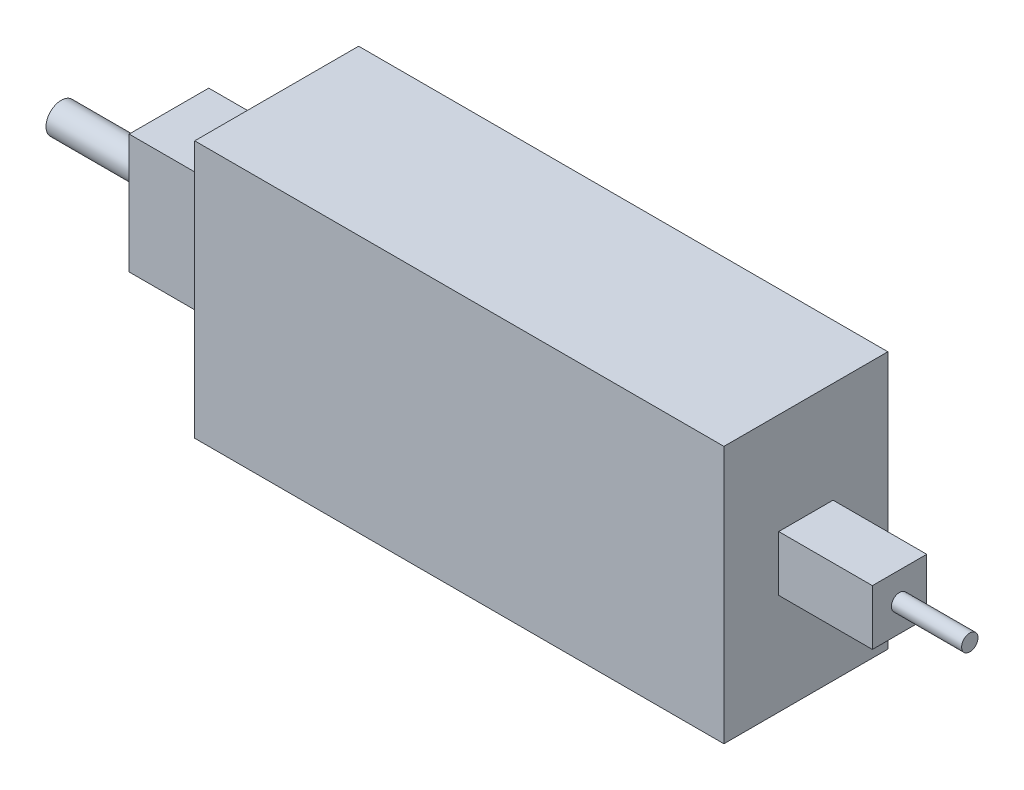
ISO-10303-21;
HEADER;
FILE_DESCRIPTION(('STEP AP214'),'2;1');
FILE_NAME('part.step','',(''),(''),'','','');
FILE_SCHEMA(('AUTOMOTIVE_DESIGN { 1 0 10303 214 1 1 1 1 }'));
ENDSEC;
DATA;
#1=APPLICATION_CONTEXT('core data for automotive mechanical design processes');
#2=APPLICATION_PROTOCOL_DEFINITION('international standard','automotive_design',2000,#1);
#3=PRODUCT_CONTEXT('',#1,'mechanical');
#4=PRODUCT('Part','Part','',(#3));
#5=PRODUCT_RELATED_PRODUCT_CATEGORY('part','',(#4));
#6=PRODUCT_DEFINITION_FORMATION('','',#4);
#7=PRODUCT_DEFINITION_CONTEXT('part definition',#1,'design');
#8=PRODUCT_DEFINITION('design','',#6,#7);
#9=PRODUCT_DEFINITION_SHAPE('','',#8);
#10=(LENGTH_UNIT() NAMED_UNIT(*) SI_UNIT(.MILLI.,.METRE.));
#11=(NAMED_UNIT(*) PLANE_ANGLE_UNIT() SI_UNIT($,.RADIAN.));
#12=(NAMED_UNIT(*) SI_UNIT($,.STERADIAN.) SOLID_ANGLE_UNIT());
#13=UNCERTAINTY_MEASURE_WITH_UNIT(LENGTH_MEASURE(1.E-05),#10,'distance_accuracy_value','');
#14=(GEOMETRIC_REPRESENTATION_CONTEXT(3) GLOBAL_UNCERTAINTY_ASSIGNED_CONTEXT((#13)) GLOBAL_UNIT_ASSIGNED_CONTEXT((#10,
#11,#12)) REPRESENTATION_CONTEXT('',''));
#15=CARTESIAN_POINT('',(0.,0.,0.));
#16=DIRECTION('',(0.,0.,1.));
#17=DIRECTION('',(1.,0.,0.));
#18=AXIS2_PLACEMENT_3D('',#15,#16,#17);
#19=CARTESIAN_POINT('',(0.,0.,35.));
#20=DIRECTION('',(1.,0.,0.));
#21=DIRECTION('',(0.,0.,-1.));
#22=AXIS2_PLACEMENT_3D('',#19,#20,#21);
#23=PLANE('',#22);
#24=DIRECTION('',(0.,-1.,0.));
#25=VECTOR('',#24,1.);
#26=CARTESIAN_POINT('',(0.,0.,0.));
#27=LINE('',#26,#25);
#28=CARTESIAN_POINT('',(0.,55.,0.));
#29=VERTEX_POINT('',#28);
#30=CARTESIAN_POINT('',(0.,0.,0.));
#31=VERTEX_POINT('',#30);
#32=EDGE_CURVE('E190',#29,#31,#27,.T.);
#33=ORIENTED_EDGE('',*,*,#32,.T.);
#34=DIRECTION('',(0.,0.,-1.));
#35=VECTOR('',#34,1.);
#36=CARTESIAN_POINT('',(0.,0.,35.));
#37=LINE('',#36,#35);
#38=CARTESIAN_POINT('',(0.,0.,35.));
#39=VERTEX_POINT('',#38);
#40=EDGE_CURVE('E40',#39,#31,#37,.T.);
#41=ORIENTED_EDGE('',*,*,#40,.F.);
#42=DIRECTION('',(0.,-1.,0.));
#43=VECTOR('',#42,1.);
#44=CARTESIAN_POINT('',(0.,0.,35.));
#45=LINE('',#44,#43);
#46=CARTESIAN_POINT('',(0.,55.,35.));
#47=VERTEX_POINT('',#46);
#48=EDGE_CURVE('E191',#47,#39,#45,.T.);
#49=ORIENTED_EDGE('',*,*,#48,.F.);
#50=DIRECTION('',(0.,0.,-1.));
#51=VECTOR('',#50,1.);
#52=CARTESIAN_POINT('',(0.,55.,35.));
#53=LINE('',#52,#51);
#54=EDGE_CURVE('E201',#47,#29,#53,.T.);
#55=ORIENTED_EDGE('',*,*,#54,.T.);
#56=EDGE_LOOP('',(#33,#41,#49,#55));
#57=FACE_BOUND('',#56,.T.);
#58=DIRECTION('',(0.,-1.,0.));
#59=VECTOR('',#58,1.);
#60=CARTESIAN_POINT('',(0.,40.25,9.));
#61=LINE('',#60,#59);
#62=CARTESIAN_POINT('',(0.,40.25,9.));
#63=VERTEX_POINT('',#62);
#64=CARTESIAN_POINT('',(0.,14.75,9.00000000000001));
#65=VERTEX_POINT('',#64);
#66=EDGE_CURVE('E53',#63,#65,#61,.T.);
#67=ORIENTED_EDGE('',*,*,#66,.F.);
#68=DIRECTION('',(0.,0.,-1.));
#69=VECTOR('',#68,1.);
#70=CARTESIAN_POINT('',(0.,40.25,9.));
#71=LINE('',#70,#69);
#72=CARTESIAN_POINT('',(0.,40.25,26.));
#73=VERTEX_POINT('',#72);
#74=EDGE_CURVE('E57',#73,#63,#71,.T.);
#75=ORIENTED_EDGE('',*,*,#74,.F.);
#76=DIRECTION('',(0.,1.,0.));
#77=VECTOR('',#76,1.);
#78=CARTESIAN_POINT('',(0.,40.25,26.));
#79=LINE('',#78,#77);
#80=CARTESIAN_POINT('',(0.,14.75,26.));
#81=VERTEX_POINT('',#80);
#82=EDGE_CURVE('E452',#81,#73,#79,.T.);
#83=ORIENTED_EDGE('',*,*,#82,.F.);
#84=DIRECTION('',(0.,0.,1.));
#85=VECTOR('',#84,1.);
#86=CARTESIAN_POINT('',(0.,14.75,9.00000000000001));
#87=LINE('',#86,#85);
#88=EDGE_CURVE('E445',#65,#81,#87,.T.);
#89=ORIENTED_EDGE('',*,*,#88,.F.);
#90=EDGE_LOOP('',(#67,#75,#83,#89));
#91=FACE_BOUND('',#90,.T.);
#92=ADVANCED_FACE('F37',(#57,#91),#23,.F.);
#93=CARTESIAN_POINT('',(113.,0.,35.));
#94=DIRECTION('',(-1.,0.,0.));
#95=DIRECTION('',(0.,0.,1.));
#96=AXIS2_PLACEMENT_3D('',#93,#94,#95);
#97=PLANE('',#96);
#98=DIRECTION('',(0.,1.,0.));
#99=VECTOR('',#98,1.);
#100=CARTESIAN_POINT('',(113.,0.,0.));
#101=LINE('',#100,#99);
#102=CARTESIAN_POINT('',(113.,0.,0.));
#103=VERTEX_POINT('',#102);
#104=CARTESIAN_POINT('',(113.,55.,0.));
#105=VERTEX_POINT('',#104);
#106=EDGE_CURVE('E206',#103,#105,#101,.T.);
#107=ORIENTED_EDGE('',*,*,#106,.T.);
#108=DIRECTION('',(0.,0.,-1.));
#109=VECTOR('',#108,1.);
#110=CARTESIAN_POINT('',(113.,55.,35.));
#111=LINE('',#110,#109);
#112=CARTESIAN_POINT('',(113.,55.,35.));
#113=VERTEX_POINT('',#112);
#114=EDGE_CURVE('E211',#113,#105,#111,.T.);
#115=ORIENTED_EDGE('',*,*,#114,.F.);
#116=DIRECTION('',(0.,1.,0.));
#117=VECTOR('',#116,1.);
#118=CARTESIAN_POINT('',(113.,0.,35.));
#119=LINE('',#118,#117);
#120=CARTESIAN_POINT('',(113.,0.,35.));
#121=VERTEX_POINT('',#120);
#122=EDGE_CURVE('E197',#121,#113,#119,.T.);
#123=ORIENTED_EDGE('',*,*,#122,.F.);
#124=DIRECTION('',(0.,0.,-1.));
#125=VECTOR('',#124,1.);
#126=CARTESIAN_POINT('',(113.,0.,35.));
#127=LINE('',#126,#125);
#128=EDGE_CURVE('E213',#121,#103,#127,.T.);
#129=ORIENTED_EDGE('',*,*,#128,.T.);
#130=EDGE_LOOP('',(#107,#115,#123,#129));
#131=FACE_BOUND('',#130,.T.);
#132=DIRECTION('',(0.,-1.,0.));
#133=VECTOR('',#132,1.);
#134=CARTESIAN_POINT('',(113.,33.4,23.3));
#135=LINE('',#134,#133);
#136=CARTESIAN_POINT('',(113.,33.4,23.3));
#137=VERTEX_POINT('',#136);
#138=CARTESIAN_POINT('',(113.,21.6,23.3));
#139=VERTEX_POINT('',#138);
#140=EDGE_CURVE('E150',#137,#139,#135,.T.);
#141=ORIENTED_EDGE('',*,*,#140,.F.);
#142=DIRECTION('',(0.,0.,1.));
#143=VECTOR('',#142,1.);
#144=CARTESIAN_POINT('',(113.,33.4,23.3));
#145=LINE('',#144,#143);
#146=CARTESIAN_POINT('',(113.,33.4,11.7));
#147=VERTEX_POINT('',#146);
#148=EDGE_CURVE('E162',#147,#137,#145,.T.);
#149=ORIENTED_EDGE('',*,*,#148,.F.);
#150=DIRECTION('',(0.,1.,0.));
#151=VECTOR('',#150,1.);
#152=CARTESIAN_POINT('',(113.,33.4,11.7));
#153=LINE('',#152,#151);
#154=CARTESIAN_POINT('',(113.,21.6,11.7));
#155=VERTEX_POINT('',#154);
#156=EDGE_CURVE('E174',#155,#147,#153,.T.);
#157=ORIENTED_EDGE('',*,*,#156,.F.);
#158=DIRECTION('',(0.,0.,-1.));
#159=VECTOR('',#158,1.);
#160=CARTESIAN_POINT('',(113.,21.6,23.3));
#161=LINE('',#160,#159);
#162=EDGE_CURVE('E171',#139,#155,#161,.T.);
#163=ORIENTED_EDGE('',*,*,#162,.F.);
#164=EDGE_LOOP('',(#141,#149,#157,#163));
#165=FACE_BOUND('',#164,.T.);
#166=ADVANCED_FACE('F231',(#131,#165),#97,.F.);
#167=CARTESIAN_POINT('',(0.,0.,35.));
#168=DIRECTION('',(0.,1.,0.));
#169=DIRECTION('',(0.,0.,1.));
#170=AXIS2_PLACEMENT_3D('',#167,#168,#169);
#171=PLANE('',#170);
#172=DIRECTION('',(1.,0.,0.));
#173=VECTOR('',#172,1.);
#174=CARTESIAN_POINT('',(0.,0.,0.));
#175=LINE('',#174,#173);
#176=EDGE_CURVE('E204',#31,#103,#175,.T.);
#177=ORIENTED_EDGE('',*,*,#176,.T.);
#178=ORIENTED_EDGE('',*,*,#128,.F.);
#179=DIRECTION('',(1.,0.,0.));
#180=VECTOR('',#179,1.);
#181=CARTESIAN_POINT('',(0.,0.,35.));
#182=LINE('',#181,#180);
#183=EDGE_CURVE('E194',#39,#121,#182,.T.);
#184=ORIENTED_EDGE('',*,*,#183,.F.);
#185=ORIENTED_EDGE('',*,*,#40,.T.);
#186=EDGE_LOOP('',(#177,#178,#184,#185));
#187=FACE_BOUND('',#186,.T.);
#188=ADVANCED_FACE('F222',(#187),#171,.F.);
#189=CARTESIAN_POINT('',(0.,55.,35.));
#190=DIRECTION('',(0.,-1.,0.));
#191=DIRECTION('',(0.,0.,-1.));
#192=AXIS2_PLACEMENT_3D('',#189,#190,#191);
#193=PLANE('',#192);
#194=DIRECTION('',(-1.,0.,0.));
#195=VECTOR('',#194,1.);
#196=CARTESIAN_POINT('',(0.,55.,0.));
#197=LINE('',#196,#195);
#198=EDGE_CURVE('E195',#105,#29,#197,.T.);
#199=ORIENTED_EDGE('',*,*,#198,.T.);
#200=ORIENTED_EDGE('',*,*,#54,.F.);
#201=DIRECTION('',(-1.,0.,0.));
#202=VECTOR('',#201,1.);
#203=CARTESIAN_POINT('',(0.,55.,35.));
#204=LINE('',#203,#202);
#205=EDGE_CURVE('E199',#113,#47,#204,.T.);
#206=ORIENTED_EDGE('',*,*,#205,.F.);
#207=ORIENTED_EDGE('',*,*,#114,.T.);
#208=EDGE_LOOP('',(#199,#200,#206,#207));
#209=FACE_BOUND('',#208,.T.);
#210=ADVANCED_FACE('F235',(#209),#193,.F.);
#211=CARTESIAN_POINT('',(0.,0.,35.));
#212=DIRECTION('',(0.,0.,-1.));
#213=DIRECTION('',(-1.,0.,0.));
#214=AXIS2_PLACEMENT_3D('',#211,#212,#213);
#215=PLANE('',#214);
#216=ORIENTED_EDGE('',*,*,#48,.T.);
#217=ORIENTED_EDGE('',*,*,#183,.T.);
#218=ORIENTED_EDGE('',*,*,#122,.T.);
#219=ORIENTED_EDGE('',*,*,#205,.T.);
#220=EDGE_LOOP('',(#216,#217,#218,#219));
#221=FACE_BOUND('',#220,.T.);
#222=ADVANCED_FACE('F237',(#221),#215,.F.);
#223=CARTESIAN_POINT('',(0.,0.,0.));
#224=DIRECTION('',(0.,0.,-1.));
#225=DIRECTION('',(-1.,0.,0.));
#226=AXIS2_PLACEMENT_3D('',#223,#224,#225);
#227=PLANE('',#226);
#228=ORIENTED_EDGE('',*,*,#32,.F.);
#229=ORIENTED_EDGE('',*,*,#198,.F.);
#230=ORIENTED_EDGE('',*,*,#106,.F.);
#231=ORIENTED_EDGE('',*,*,#176,.F.);
#232=EDGE_LOOP('',(#228,#229,#230,#231));
#233=FACE_BOUND('',#232,.T.);
#234=ADVANCED_FACE('F229',(#233),#227,.T.);
#235=CARTESIAN_POINT('',(133.,33.4,23.3));
#236=DIRECTION('',(0.,0.,-1.));
#237=DIRECTION('',(-1.,0.,0.));
#238=AXIS2_PLACEMENT_3D('',#235,#236,#237);
#239=PLANE('',#238);
#240=ORIENTED_EDGE('',*,*,#140,.T.);
#241=DIRECTION('',(-1.,0.,0.));
#242=VECTOR('',#241,1.);
#243=CARTESIAN_POINT('',(133.,21.6,23.3));
#244=LINE('',#243,#242);
#245=CARTESIAN_POINT('',(133.,21.6,23.3));
#246=VERTEX_POINT('',#245);
#247=EDGE_CURVE('E187',#246,#139,#244,.T.);
#248=ORIENTED_EDGE('',*,*,#247,.F.);
#249=DIRECTION('',(0.,-1.,0.));
#250=VECTOR('',#249,1.);
#251=CARTESIAN_POINT('',(133.,33.4,23.3));
#252=LINE('',#251,#250);
#253=CARTESIAN_POINT('',(133.,33.4,23.3));
#254=VERTEX_POINT('',#253);
#255=EDGE_CURVE('E158',#254,#246,#252,.T.);
#256=ORIENTED_EDGE('',*,*,#255,.F.);
#257=DIRECTION('',(-1.,0.,0.));
#258=VECTOR('',#257,1.);
#259=CARTESIAN_POINT('',(133.,33.4,23.3));
#260=LINE('',#259,#258);
#261=EDGE_CURVE('E168',#254,#137,#260,.T.);
#262=ORIENTED_EDGE('',*,*,#261,.T.);
#263=EDGE_LOOP('',(#240,#248,#256,#262));
#264=FACE_BOUND('',#263,.T.);
#265=ADVANCED_FACE('F244',(#264),#239,.F.);
#266=CARTESIAN_POINT('',(133.,21.6,23.3));
#267=DIRECTION('',(0.,1.,0.));
#268=DIRECTION('',(-1.,0.,0.));
#269=AXIS2_PLACEMENT_3D('',#266,#267,#268);
#270=PLANE('',#269);
#271=ORIENTED_EDGE('',*,*,#162,.T.);
#272=DIRECTION('',(-1.,0.,0.));
#273=VECTOR('',#272,1.);
#274=CARTESIAN_POINT('',(133.,21.6,11.7));
#275=LINE('',#274,#273);
#276=CARTESIAN_POINT('',(133.,21.6,11.7));
#277=VERTEX_POINT('',#276);
#278=EDGE_CURVE('E184',#277,#155,#275,.T.);
#279=ORIENTED_EDGE('',*,*,#278,.F.);
#280=DIRECTION('',(0.,0.,-1.));
#281=VECTOR('',#280,1.);
#282=CARTESIAN_POINT('',(133.,21.6,23.3));
#283=LINE('',#282,#281);
#284=EDGE_CURVE('E161',#246,#277,#283,.T.);
#285=ORIENTED_EDGE('',*,*,#284,.F.);
#286=ORIENTED_EDGE('',*,*,#247,.T.);
#287=EDGE_LOOP('',(#271,#279,#285,#286));
#288=FACE_BOUND('',#287,.T.);
#289=ADVANCED_FACE('F289',(#288),#270,.F.);
#290=CARTESIAN_POINT('',(133.,33.4,11.7));
#291=DIRECTION('',(0.,0.,1.));
#292=DIRECTION('',(0.,-1.,0.));
#293=AXIS2_PLACEMENT_3D('',#290,#291,#292);
#294=PLANE('',#293);
#295=ORIENTED_EDGE('',*,*,#156,.T.);
#296=DIRECTION('',(-1.,0.,0.));
#297=VECTOR('',#296,1.);
#298=CARTESIAN_POINT('',(133.,33.4,11.7));
#299=LINE('',#298,#297);
#300=CARTESIAN_POINT('',(133.,33.4,11.7));
#301=VERTEX_POINT('',#300);
#302=EDGE_CURVE('E181',#301,#147,#299,.T.);
#303=ORIENTED_EDGE('',*,*,#302,.F.);
#304=DIRECTION('',(0.,1.,0.));
#305=VECTOR('',#304,1.);
#306=CARTESIAN_POINT('',(133.,33.4,11.7));
#307=LINE('',#306,#305);
#308=EDGE_CURVE('E164',#277,#301,#307,.T.);
#309=ORIENTED_EDGE('',*,*,#308,.F.);
#310=ORIENTED_EDGE('',*,*,#278,.T.);
#311=EDGE_LOOP('',(#295,#303,#309,#310));
#312=FACE_BOUND('',#311,.T.);
#313=ADVANCED_FACE('F298',(#312),#294,.F.);
#314=CARTESIAN_POINT('',(133.,33.4,23.3));
#315=DIRECTION('',(0.,-1.,0.));
#316=DIRECTION('',(1.,0.,0.));
#317=AXIS2_PLACEMENT_3D('',#314,#315,#316);
#318=PLANE('',#317);
#319=ORIENTED_EDGE('',*,*,#148,.T.);
#320=ORIENTED_EDGE('',*,*,#261,.F.);
#321=DIRECTION('',(0.,0.,1.));
#322=VECTOR('',#321,1.);
#323=CARTESIAN_POINT('',(133.,33.4,23.3));
#324=LINE('',#323,#322);
#325=EDGE_CURVE('E166',#301,#254,#324,.T.);
#326=ORIENTED_EDGE('',*,*,#325,.F.);
#327=ORIENTED_EDGE('',*,*,#302,.T.);
#328=EDGE_LOOP('',(#319,#320,#326,#327));
#329=FACE_BOUND('',#328,.T.);
#330=ADVANCED_FACE('F309',(#329),#318,.F.);
#331=CARTESIAN_POINT('',(133.,1.45513630249888E-13,0.));
#332=DIRECTION('',(1.,0.,0.));
#333=DIRECTION('',(0.,1.,0.));
#334=AXIS2_PLACEMENT_3D('',#331,#332,#333);
#335=PLANE('',#334);
#336=CARTESIAN_POINT('',(133.,27.5,17.5));
#337=DIRECTION('',(1.,0.,0.));
#338=DIRECTION('',(0.,1.,0.));
#339=AXIS2_PLACEMENT_3D('',#336,#337,#338);
#340=CIRCLE('',#339,1.75);
#341=CARTESIAN_POINT('',(133.,29.25,17.5));
#342=VERTEX_POINT('',#341);
#343=EDGE_CURVE('E45',#342,#342,#340,.T.);
#344=ORIENTED_EDGE('',*,*,#343,.F.);
#345=EDGE_LOOP('',(#344));
#346=FACE_BOUND('',#345,.T.);
#347=ORIENTED_EDGE('',*,*,#255,.T.);
#348=ORIENTED_EDGE('',*,*,#284,.T.);
#349=ORIENTED_EDGE('',*,*,#308,.T.);
#350=ORIENTED_EDGE('',*,*,#325,.T.);
#351=EDGE_LOOP('',(#347,#348,#349,#350));
#352=FACE_BOUND('',#351,.T.);
#353=ADVANCED_FACE('F320',(#346,#352),#335,.T.);
#354=CARTESIAN_POINT('',(148.,27.5,17.5));
#355=DIRECTION('',(-1.,0.,0.));
#356=DIRECTION('',(0.,-1.,0.));
#357=AXIS2_PLACEMENT_3D('',#354,#355,#356);
#358=CYLINDRICAL_SURFACE('',#357,1.75);
#359=CARTESIAN_POINT('',(148.,27.5,17.5));
#360=DIRECTION('',(1.,0.,0.));
#361=DIRECTION('',(0.,1.,0.));
#362=AXIS2_PLACEMENT_3D('',#359,#360,#361);
#363=CIRCLE('',#362,1.75);
#364=CARTESIAN_POINT('',(148.,29.25,17.5));
#365=VERTEX_POINT('',#364);
#366=EDGE_CURVE('E147',#365,#365,#363,.T.);
#367=ORIENTED_EDGE('',*,*,#366,.F.);
#368=EDGE_LOOP('',(#367));
#369=FACE_BOUND('',#368,.T.);
#370=ORIENTED_EDGE('',*,*,#343,.T.);
#371=EDGE_LOOP('',(#370));
#372=FACE_BOUND('',#371,.T.);
#373=ADVANCED_FACE('F331',(#369,#372),#358,.T.);
#374=CARTESIAN_POINT('',(148.,27.5,17.5));
#375=DIRECTION('',(1.,0.,0.));
#376=DIRECTION('',(0.,1.,0.));
#377=AXIS2_PLACEMENT_3D('',#374,#375,#376);
#378=PLANE('',#377);
#379=ORIENTED_EDGE('',*,*,#366,.T.);
#380=EDGE_LOOP('',(#379));
#381=FACE_BOUND('',#380,.T.);
#382=ADVANCED_FACE('F342',(#381),#378,.T.);
#383=CARTESIAN_POINT('',(-23.,40.25,9.));
#384=DIRECTION('',(0.,0.,1.));
#385=DIRECTION('',(0.,-1.,0.));
#386=AXIS2_PLACEMENT_3D('',#383,#384,#385);
#387=PLANE('',#386);
#388=ORIENTED_EDGE('',*,*,#66,.T.);
#389=DIRECTION('',(1.,0.,0.));
#390=VECTOR('',#389,1.);
#391=CARTESIAN_POINT('',(-23.,14.75,9.00000000000001));
#392=LINE('',#391,#390);
#393=CARTESIAN_POINT('',(-23.,14.75,9.00000000000001));
#394=VERTEX_POINT('',#393);
#395=EDGE_CURVE('E130',#394,#65,#392,.T.);
#396=ORIENTED_EDGE('',*,*,#395,.F.);
#397=DIRECTION('',(0.,-1.,0.));
#398=VECTOR('',#397,1.);
#399=CARTESIAN_POINT('',(-23.,40.25,9.));
#400=LINE('',#399,#398);
#401=CARTESIAN_POINT('',(-23.,40.25,9.));
#402=VERTEX_POINT('',#401);
#403=EDGE_CURVE('E136',#402,#394,#400,.T.);
#404=ORIENTED_EDGE('',*,*,#403,.F.);
#405=DIRECTION('',(1.,0.,0.));
#406=VECTOR('',#405,1.);
#407=CARTESIAN_POINT('',(-23.,40.25,9.));
#408=LINE('',#407,#406);
#409=EDGE_CURVE('E449',#402,#63,#408,.T.);
#410=ORIENTED_EDGE('',*,*,#409,.T.);
#411=EDGE_LOOP('',(#388,#396,#404,#410));
#412=FACE_BOUND('',#411,.T.);
#413=ADVANCED_FACE('F146',(#412),#387,.F.);
#414=CARTESIAN_POINT('',(-23.,14.75,9.00000000000001));
#415=DIRECTION('',(0.,1.,0.));
#416=DIRECTION('',(0.,0.,1.));
#417=AXIS2_PLACEMENT_3D('',#414,#415,#416);
#418=PLANE('',#417);
#419=ORIENTED_EDGE('',*,*,#88,.T.);
#420=DIRECTION('',(1.,0.,0.));
#421=VECTOR('',#420,1.);
#422=CARTESIAN_POINT('',(-23.,14.75,26.));
#423=LINE('',#422,#421);
#424=CARTESIAN_POINT('',(-23.,14.75,26.));
#425=VERTEX_POINT('',#424);
#426=EDGE_CURVE('E132',#425,#81,#423,.T.);
#427=ORIENTED_EDGE('',*,*,#426,.F.);
#428=DIRECTION('',(0.,0.,1.));
#429=VECTOR('',#428,1.);
#430=CARTESIAN_POINT('',(-23.,14.75,9.00000000000001));
#431=LINE('',#430,#429);
#432=EDGE_CURVE('E125',#394,#425,#431,.T.);
#433=ORIENTED_EDGE('',*,*,#432,.F.);
#434=ORIENTED_EDGE('',*,*,#395,.T.);
#435=EDGE_LOOP('',(#419,#427,#433,#434));
#436=FACE_BOUND('',#435,.T.);
#437=ADVANCED_FACE('F128',(#436),#418,.F.);
#438=CARTESIAN_POINT('',(-23.,40.25,26.));
#439=DIRECTION('',(0.,0.,-1.));
#440=DIRECTION('',(-1.,0.,0.));
#441=AXIS2_PLACEMENT_3D('',#438,#439,#440);
#442=PLANE('',#441);
#443=ORIENTED_EDGE('',*,*,#82,.T.);
#444=DIRECTION('',(1.,0.,0.));
#445=VECTOR('',#444,1.);
#446=CARTESIAN_POINT('',(-23.,40.25,26.));
#447=LINE('',#446,#445);
#448=CARTESIAN_POINT('',(-23.,40.25,26.));
#449=VERTEX_POINT('',#448);
#450=EDGE_CURVE('E152',#449,#73,#447,.T.);
#451=ORIENTED_EDGE('',*,*,#450,.F.);
#452=DIRECTION('',(0.,1.,0.));
#453=VECTOR('',#452,1.);
#454=CARTESIAN_POINT('',(-23.,40.25,26.));
#455=LINE('',#454,#453);
#456=EDGE_CURVE('E135',#425,#449,#455,.T.);
#457=ORIENTED_EDGE('',*,*,#456,.F.);
#458=ORIENTED_EDGE('',*,*,#426,.T.);
#459=EDGE_LOOP('',(#443,#451,#457,#458));
#460=FACE_BOUND('',#459,.T.);
#461=ADVANCED_FACE('F376',(#460),#442,.F.);
#462=CARTESIAN_POINT('',(-23.,40.25,9.));
#463=DIRECTION('',(0.,-1.,0.));
#464=DIRECTION('',(0.,0.,-1.));
#465=AXIS2_PLACEMENT_3D('',#462,#463,#464);
#466=PLANE('',#465);
#467=ORIENTED_EDGE('',*,*,#74,.T.);
#468=ORIENTED_EDGE('',*,*,#409,.F.);
#469=DIRECTION('',(0.,0.,-1.));
#470=VECTOR('',#469,1.);
#471=CARTESIAN_POINT('',(-23.,40.25,9.));
#472=LINE('',#471,#470);
#473=EDGE_CURVE('E141',#449,#402,#472,.T.);
#474=ORIENTED_EDGE('',*,*,#473,.F.);
#475=ORIENTED_EDGE('',*,*,#450,.T.);
#476=EDGE_LOOP('',(#467,#468,#474,#475));
#477=FACE_BOUND('',#476,.T.);
#478=ADVANCED_FACE('F386',(#477),#466,.F.);
#479=CARTESIAN_POINT('',(-23.,0.,0.));
#480=DIRECTION('',(-1.,0.,0.));
#481=DIRECTION('',(0.,0.,1.));
#482=AXIS2_PLACEMENT_3D('',#479,#480,#481);
#483=PLANE('',#482);
#484=CARTESIAN_POINT('',(-23.,27.5,17.5));
#485=DIRECTION('',(-1.,0.,0.));
#486=DIRECTION('',(0.,0.,1.));
#487=AXIS2_PLACEMENT_3D('',#484,#485,#486);
#488=CIRCLE('',#487,3.25);
#489=CARTESIAN_POINT('',(-23.,27.5,20.75));
#490=VERTEX_POINT('',#489);
#491=EDGE_CURVE('E11',#490,#490,#488,.T.);
#492=ORIENTED_EDGE('',*,*,#491,.F.);
#493=EDGE_LOOP('',(#492));
#494=FACE_BOUND('',#493,.T.);
#495=ORIENTED_EDGE('',*,*,#403,.T.);
#496=ORIENTED_EDGE('',*,*,#432,.T.);
#497=ORIENTED_EDGE('',*,*,#456,.T.);
#498=ORIENTED_EDGE('',*,*,#473,.T.);
#499=EDGE_LOOP('',(#495,#496,#497,#498));
#500=FACE_BOUND('',#499,.T.);
#501=ADVANCED_FACE('F139',(#494,#500),#483,.T.);
#502=CARTESIAN_POINT('',(-46.,27.5,17.5));
#503=DIRECTION('',(1.,0.,0.));
#504=DIRECTION('',(0.,0.,-1.));
#505=AXIS2_PLACEMENT_3D('',#502,#503,#504);
#506=CYLINDRICAL_SURFACE('',#505,3.25);
#507=CARTESIAN_POINT('',(-46.,27.5,17.5));
#508=DIRECTION('',(-1.,0.,0.));
#509=DIRECTION('',(0.,0.,1.));
#510=AXIS2_PLACEMENT_3D('',#507,#508,#509);
#511=CIRCLE('',#510,3.25);
#512=CARTESIAN_POINT('',(-46.,27.5,20.75));
#513=VERTEX_POINT('',#512);
#514=EDGE_CURVE('E443',#513,#513,#511,.T.);
#515=ORIENTED_EDGE('',*,*,#514,.F.);
#516=EDGE_LOOP('',(#515));
#517=FACE_BOUND('',#516,.T.);
#518=ORIENTED_EDGE('',*,*,#491,.T.);
#519=EDGE_LOOP('',(#518));
#520=FACE_BOUND('',#519,.T.);
#521=ADVANCED_FACE('F407',(#517,#520),#506,.T.);
#522=CARTESIAN_POINT('',(-46.,27.5,17.5));
#523=DIRECTION('',(-1.,0.,0.));
#524=DIRECTION('',(0.,0.,1.));
#525=AXIS2_PLACEMENT_3D('',#522,#523,#524);
#526=PLANE('',#525);
#527=ORIENTED_EDGE('',*,*,#514,.T.);
#528=EDGE_LOOP('',(#527));
#529=FACE_BOUND('',#528,.T.);
#530=ADVANCED_FACE('F418',(#529),#526,.T.);
#531=CLOSED_SHELL('',(#92,#166,#188,#210,#222,#234,#265,#289,#313,#330,#353,#373,#382,#413,#437,
#461,#478,#501,#521,#530));
#532=MANIFOLD_SOLID_BREP('B2',#531);
#533=ADVANCED_BREP_SHAPE_REPRESENTATION('',(#18,#532),#14);
#534=SHAPE_DEFINITION_REPRESENTATION(#9,#533);
ENDSEC;
END-ISO-10303-21;
